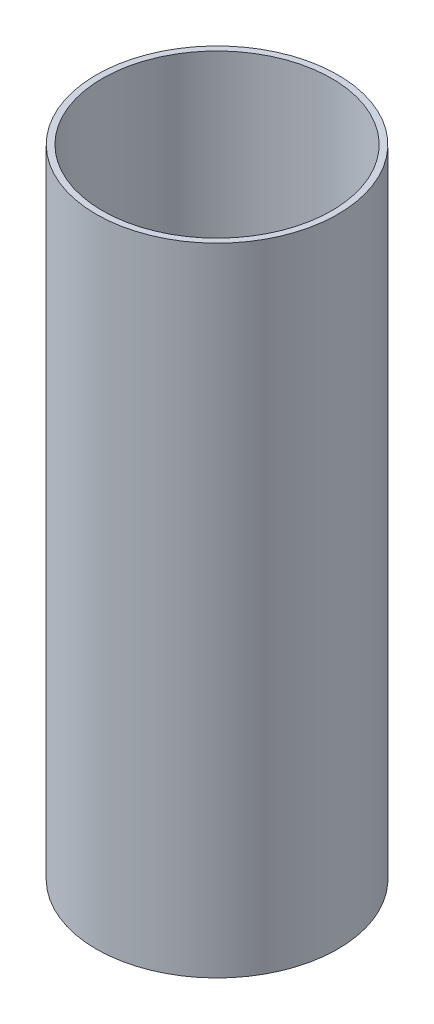
ISO-10303-21;
HEADER;
FILE_DESCRIPTION(('STEP AP214'),'2;1');
FILE_NAME('part.step','',(''),(''),'','','');
FILE_SCHEMA(('AUTOMOTIVE_DESIGN { 1 0 10303 214 1 1 1 1 }'));
ENDSEC;
DATA;
#1=APPLICATION_CONTEXT('core data for automotive mechanical design processes');
#2=APPLICATION_PROTOCOL_DEFINITION('international standard','automotive_design',2000,#1);
#3=PRODUCT_CONTEXT('',#1,'mechanical');
#4=PRODUCT('Part','Part','',(#3));
#5=PRODUCT_RELATED_PRODUCT_CATEGORY('part','',(#4));
#6=PRODUCT_DEFINITION_FORMATION('','',#4);
#7=PRODUCT_DEFINITION_CONTEXT('part definition',#1,'design');
#8=PRODUCT_DEFINITION('design','',#6,#7);
#9=PRODUCT_DEFINITION_SHAPE('','',#8);
#10=(LENGTH_UNIT() NAMED_UNIT(*) SI_UNIT(.MILLI.,.METRE.));
#11=(NAMED_UNIT(*) PLANE_ANGLE_UNIT() SI_UNIT($,.RADIAN.));
#12=(NAMED_UNIT(*) SI_UNIT($,.STERADIAN.) SOLID_ANGLE_UNIT());
#13=UNCERTAINTY_MEASURE_WITH_UNIT(LENGTH_MEASURE(1.E-05),#10,'distance_accuracy_value','');
#14=(GEOMETRIC_REPRESENTATION_CONTEXT(3) GLOBAL_UNCERTAINTY_ASSIGNED_CONTEXT((#13)) GLOBAL_UNIT_ASSIGNED_CONTEXT((#10,
#11,#12)) REPRESENTATION_CONTEXT('',''));
#15=CARTESIAN_POINT('',(0.,0.,0.));
#16=DIRECTION('',(0.,0.,1.));
#17=DIRECTION('',(1.,0.,0.));
#18=AXIS2_PLACEMENT_3D('',#15,#16,#17);
#19=CARTESIAN_POINT('',(0.,246.71401,0.));
#20=DIRECTION('',(0.,1.,0.));
#21=DIRECTION('',(0.,0.,1.));
#22=AXIS2_PLACEMENT_3D('',#19,#20,#21);
#23=PLANE('',#22);
#24=CARTESIAN_POINT('',(0.,246.71401,0.));
#25=DIRECTION('',(0.,1.,0.));
#26=DIRECTION('',(0.,0.,1.));
#27=AXIS2_PLACEMENT_3D('',#24,#25,#26);
#28=CIRCLE('',#27,93.6625);
#29=CARTESIAN_POINT('',(0.,246.71401,93.6625));
#30=VERTEX_POINT('',#29);
#31=EDGE_CURVE('E10',#30,#30,#28,.T.);
#32=ORIENTED_EDGE('',*,*,#31,.T.);
#33=EDGE_LOOP('',(#32));
#34=FACE_BOUND('',#33,.T.);
#35=CARTESIAN_POINT('',(0.,246.71401,0.));
#36=DIRECTION('',(0.,1.,0.));
#37=DIRECTION('',(0.,0.,1.));
#38=AXIS2_PLACEMENT_3D('',#35,#36,#37);
#39=CIRCLE('',#38,88.9);
#40=CARTESIAN_POINT('',(0.,246.71401,88.9));
#41=VERTEX_POINT('',#40);
#42=EDGE_CURVE('E46',#41,#41,#39,.T.);
#43=ORIENTED_EDGE('',*,*,#42,.F.);
#44=EDGE_LOOP('',(#43));
#45=FACE_BOUND('',#44,.T.);
#46=ADVANCED_FACE('F35',(#34,#45),#23,.T.);
#47=CARTESIAN_POINT('',(0.,-246.71401,0.));
#48=DIRECTION('',(0.,1.,0.));
#49=DIRECTION('',(0.,0.,1.));
#50=AXIS2_PLACEMENT_3D('',#47,#48,#49);
#51=PLANE('',#50);
#52=CARTESIAN_POINT('',(0.,-246.71401,0.));
#53=DIRECTION('',(0.,1.,0.));
#54=DIRECTION('',(0.,0.,1.));
#55=AXIS2_PLACEMENT_3D('',#52,#53,#54);
#56=CIRCLE('',#55,93.6625);
#57=CARTESIAN_POINT('',(0.,-246.71401,93.6625));
#58=VERTEX_POINT('',#57);
#59=EDGE_CURVE('E39',#58,#58,#56,.T.);
#60=ORIENTED_EDGE('',*,*,#59,.F.);
#61=EDGE_LOOP('',(#60));
#62=FACE_BOUND('',#61,.T.);
#63=CARTESIAN_POINT('',(0.,-246.71401,0.));
#64=DIRECTION('',(0.,1.,0.));
#65=DIRECTION('',(0.,0.,1.));
#66=AXIS2_PLACEMENT_3D('',#63,#64,#65);
#67=CIRCLE('',#66,88.9);
#68=CARTESIAN_POINT('',(0.,-246.71401,88.9));
#69=VERTEX_POINT('',#68);
#70=EDGE_CURVE('E48',#69,#69,#67,.T.);
#71=ORIENTED_EDGE('',*,*,#70,.T.);
#72=EDGE_LOOP('',(#71));
#73=FACE_BOUND('',#72,.T.);
#74=ADVANCED_FACE('F58',(#62,#73),#51,.F.);
#75=CARTESIAN_POINT('',(0.,246.71401,0.));
#76=DIRECTION('',(0.,-1.,0.));
#77=DIRECTION('',(0.,0.,-1.));
#78=AXIS2_PLACEMENT_3D('',#75,#76,#77);
#79=CYLINDRICAL_SURFACE('',#78,93.6625);
#80=ORIENTED_EDGE('',*,*,#31,.F.);
#81=EDGE_LOOP('',(#80));
#82=FACE_BOUND('',#81,.T.);
#83=ORIENTED_EDGE('',*,*,#59,.T.);
#84=EDGE_LOOP('',(#83));
#85=FACE_BOUND('',#84,.T.);
#86=ADVANCED_FACE('F37',(#82,#85),#79,.T.);
#87=CARTESIAN_POINT('',(0.,246.71401,0.));
#88=DIRECTION('',(0.,-1.,0.));
#89=DIRECTION('',(0.,0.,-1.));
#90=AXIS2_PLACEMENT_3D('',#87,#88,#89);
#91=CYLINDRICAL_SURFACE('',#90,88.9);
#92=ORIENTED_EDGE('',*,*,#42,.T.);
#93=EDGE_LOOP('',(#92));
#94=FACE_BOUND('',#93,.T.);
#95=ORIENTED_EDGE('',*,*,#70,.F.);
#96=EDGE_LOOP('',(#95));
#97=FACE_BOUND('',#96,.T.);
#98=ADVANCED_FACE('F54',(#94,#97),#91,.F.);
#99=CLOSED_SHELL('',(#46,#74,#86,#98));
#100=MANIFOLD_SOLID_BREP('B2',#99);
#101=ADVANCED_BREP_SHAPE_REPRESENTATION('',(#18,#100),#14);
#102=SHAPE_DEFINITION_REPRESENTATION(#9,#101);
ENDSEC;
END-ISO-10303-21;
